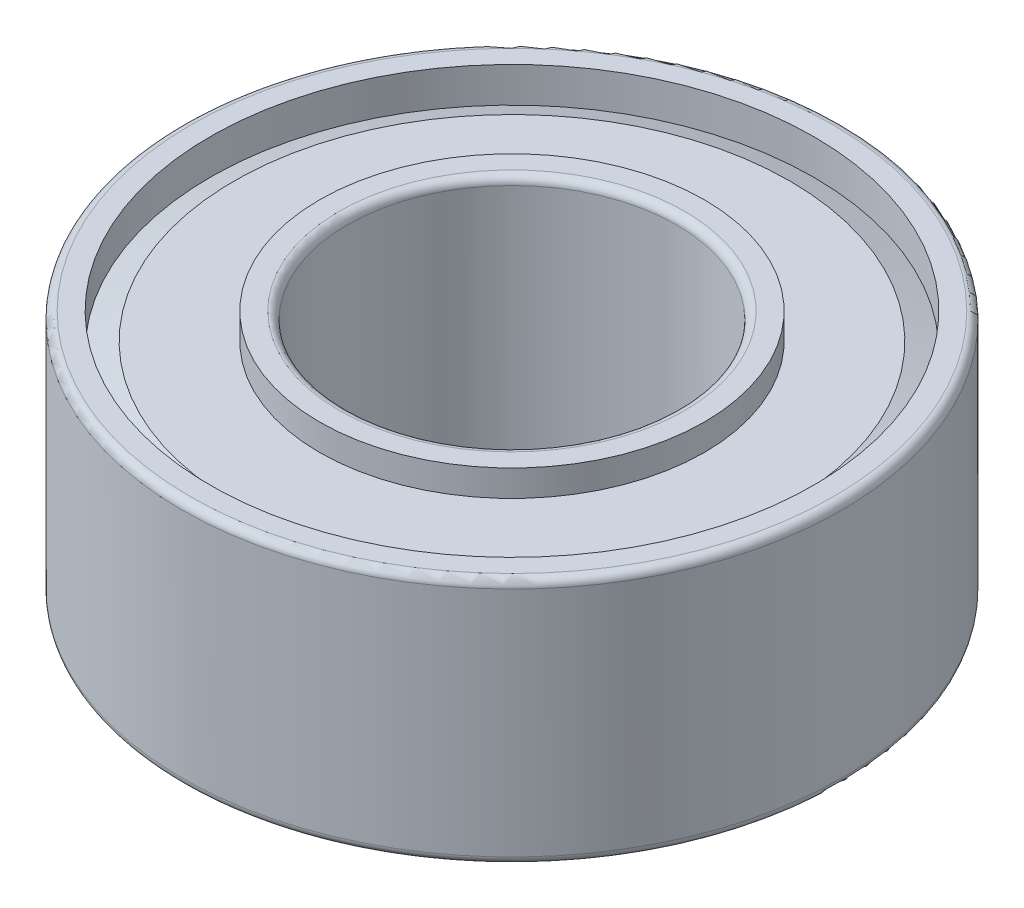
ISO-10303-21;
HEADER;
FILE_DESCRIPTION(('STEP AP214'),'2;1');
FILE_NAME('part.step','',(''),(''),'','','');
FILE_SCHEMA(('AUTOMOTIVE_DESIGN { 1 0 10303 214 1 1 1 1 }'));
ENDSEC;
DATA;
#1=APPLICATION_CONTEXT('core data for automotive mechanical design processes');
#2=APPLICATION_PROTOCOL_DEFINITION('international standard','automotive_design',2000,#1);
#3=PRODUCT_CONTEXT('',#1,'mechanical');
#4=PRODUCT('Part','Part','',(#3));
#5=PRODUCT_RELATED_PRODUCT_CATEGORY('part','',(#4));
#6=PRODUCT_DEFINITION_FORMATION('','',#4);
#7=PRODUCT_DEFINITION_CONTEXT('part definition',#1,'design');
#8=PRODUCT_DEFINITION('design','',#6,#7);
#9=PRODUCT_DEFINITION_SHAPE('','',#8);
#10=(LENGTH_UNIT() NAMED_UNIT(*) SI_UNIT(.MILLI.,.METRE.));
#11=(NAMED_UNIT(*) PLANE_ANGLE_UNIT() SI_UNIT($,.RADIAN.));
#12=(NAMED_UNIT(*) SI_UNIT($,.STERADIAN.) SOLID_ANGLE_UNIT());
#13=UNCERTAINTY_MEASURE_WITH_UNIT(LENGTH_MEASURE(1.E-05),#10,'distance_accuracy_value','');
#14=(GEOMETRIC_REPRESENTATION_CONTEXT(3) GLOBAL_UNCERTAINTY_ASSIGNED_CONTEXT((#13)) GLOBAL_UNIT_ASSIGNED_CONTEXT((#10,
#11,#12)) REPRESENTATION_CONTEXT('',''));
#15=CARTESIAN_POINT('',(0.,0.,0.));
#16=DIRECTION('',(0.,0.,1.));
#17=DIRECTION('',(1.,0.,0.));
#18=AXIS2_PLACEMENT_3D('',#15,#16,#17);
#19=CARTESIAN_POINT('',(3.17500000000001,0.,0.));
#20=DIRECTION('',(0.,-1.,0.));
#21=DIRECTION('',(0.,0.,-1.));
#22=AXIS2_PLACEMENT_3D('',#19,#20,#21);
#23=PLANE('',#22);
#24=CARTESIAN_POINT('',(0.,0.,0.));
#25=DIRECTION('',(0.,-1.,0.));
#26=DIRECTION('',(0.,0.,-1.));
#27=AXIS2_PLACEMENT_3D('',#24,#25,#26);
#28=CIRCLE('',#27,6.1976);
#29=CARTESIAN_POINT('',(0.,0.,-6.1976));
#30=VERTEX_POINT('',#29);
#31=EDGE_CURVE('E46',#30,#30,#28,.T.);
#32=ORIENTED_EDGE('',*,*,#31,.T.);
#33=EDGE_LOOP('',(#32));
#34=FACE_BOUND('',#33,.T.);
#35=CARTESIAN_POINT('',(0.,0.,0.));
#36=DIRECTION('',(0.,-1.,0.));
#37=DIRECTION('',(0.,0.,-1.));
#38=AXIS2_PLACEMENT_3D('',#35,#36,#37);
#39=CIRCLE('',#38,5.8166);
#40=CARTESIAN_POINT('',(0.,0.,-5.8166));
#41=VERTEX_POINT('',#40);
#42=EDGE_CURVE('E99',#41,#41,#39,.T.);
#43=ORIENTED_EDGE('',*,*,#42,.F.);
#44=EDGE_LOOP('',(#43));
#45=FACE_BOUND('',#44,.T.);
#46=ADVANCED_FACE('F37',(#34,#45),#23,.T.);
#47=CARTESIAN_POINT('',(3.175,4.7752,0.));
#48=DIRECTION('',(0.,1.,0.));
#49=DIRECTION('',(0.,0.,1.));
#50=AXIS2_PLACEMENT_3D('',#47,#48,#49);
#51=PLANE('',#50);
#52=CARTESIAN_POINT('',(0.,4.7752,0.));
#53=DIRECTION('',(0.,1.,0.));
#54=DIRECTION('',(0.,0.,1.));
#55=AXIS2_PLACEMENT_3D('',#52,#53,#54);
#56=CIRCLE('',#55,6.1976);
#57=CARTESIAN_POINT('',(0.,4.7752,6.1976));
#58=VERTEX_POINT('',#57);
#59=EDGE_CURVE('E52',#58,#58,#56,.T.);
#60=ORIENTED_EDGE('',*,*,#59,.T.);
#61=EDGE_LOOP('',(#60));
#62=FACE_BOUND('',#61,.T.);
#63=CARTESIAN_POINT('',(0.,4.7752,0.));
#64=DIRECTION('',(0.,-1.,0.));
#65=DIRECTION('',(0.,0.,-1.));
#66=AXIS2_PLACEMENT_3D('',#63,#64,#65);
#67=CIRCLE('',#66,5.8166);
#68=CARTESIAN_POINT('',(0.,4.7752,-5.8166));
#69=VERTEX_POINT('',#68);
#70=EDGE_CURVE('E80',#69,#69,#67,.T.);
#71=ORIENTED_EDGE('',*,*,#70,.T.);
#72=EDGE_LOOP('',(#71));
#73=FACE_BOUND('',#72,.T.);
#74=ADVANCED_FACE('F138',(#62,#73),#51,.T.);
#75=CARTESIAN_POINT('',(0.,0.,0.));
#76=DIRECTION('',(0.,-1.,0.));
#77=DIRECTION('',(0.,0.,-1.));
#78=AXIS2_PLACEMENT_3D('',#75,#76,#77);
#79=CYLINDRICAL_SURFACE('',#78,3.17500000000001);
#80=CARTESIAN_POINT('',(0.,4.6228,0.));
#81=DIRECTION('',(0.,1.,0.));
#82=DIRECTION('',(0.,0.,1.));
#83=AXIS2_PLACEMENT_3D('',#80,#81,#82);
#84=CIRCLE('',#83,3.17500000000001);
#85=CARTESIAN_POINT('',(0.,4.6228,3.17500000000001));
#86=VERTEX_POINT('',#85);
#87=EDGE_CURVE('E68',#86,#86,#84,.T.);
#88=ORIENTED_EDGE('',*,*,#87,.T.);
#89=EDGE_LOOP('',(#88));
#90=FACE_BOUND('',#89,.T.);
#91=CARTESIAN_POINT('',(0.,0.1524,0.));
#92=DIRECTION('',(0.,-1.,0.));
#93=DIRECTION('',(0.,0.,-1.));
#94=AXIS2_PLACEMENT_3D('',#91,#92,#93);
#95=CIRCLE('',#94,3.17500000000001);
#96=CARTESIAN_POINT('',(0.,0.1524,-3.17500000000001));
#97=VERTEX_POINT('',#96);
#98=EDGE_CURVE('E72',#97,#97,#95,.T.);
#99=ORIENTED_EDGE('',*,*,#98,.T.);
#100=EDGE_LOOP('',(#99));
#101=FACE_BOUND('',#100,.T.);
#102=ADVANCED_FACE('F39',(#90,#101),#79,.F.);
#103=CARTESIAN_POINT('',(0.,0.,0.));
#104=DIRECTION('',(0.,-1.,0.));
#105=DIRECTION('',(0.,0.,-1.));
#106=AXIS2_PLACEMENT_3D('',#103,#104,#105);
#107=CIRCLE('',#106,3.32740000000001);
#108=CARTESIAN_POINT('',(0.,0.,-3.32740000000001));
#109=VERTEX_POINT('',#108);
#110=EDGE_CURVE('E10',#109,#109,#107,.F.);
#111=ORIENTED_EDGE('',*,*,#110,.T.);
#112=EDGE_LOOP('',(#111));
#113=FACE_BOUND('',#112,.T.);
#114=CARTESIAN_POINT('',(0.,0.,0.));
#115=DIRECTION('',(0.,-1.,0.));
#116=DIRECTION('',(0.,0.,-1.));
#117=AXIS2_PLACEMENT_3D('',#114,#115,#116);
#118=CIRCLE('',#117,3.7084);
#119=CARTESIAN_POINT('',(0.,0.,-3.7084));
#120=VERTEX_POINT('',#119);
#121=EDGE_CURVE('E114',#120,#120,#118,.T.);
#122=ORIENTED_EDGE('',*,*,#121,.T.);
#123=EDGE_LOOP('',(#122));
#124=FACE_BOUND('',#123,.T.);
#125=ADVANCED_FACE('F119',(#113,#124),#23,.T.);
#126=CARTESIAN_POINT('',(0.,0.,0.));
#127=DIRECTION('',(0.,-1.,0.));
#128=DIRECTION('',(0.,0.,-1.));
#129=AXIS2_PLACEMENT_3D('',#126,#127,#128);
#130=CYLINDRICAL_SURFACE('',#129,6.35);
#131=CARTESIAN_POINT('',(0.,4.6228,0.));
#132=DIRECTION('',(0.,1.,0.));
#133=DIRECTION('',(0.,0.,1.));
#134=AXIS2_PLACEMENT_3D('',#131,#132,#133);
#135=CIRCLE('',#134,6.35);
#136=CARTESIAN_POINT('',(0.,4.6228,6.35));
#137=VERTEX_POINT('',#136);
#138=EDGE_CURVE('E59',#137,#137,#135,.F.);
#139=ORIENTED_EDGE('',*,*,#138,.T.);
#140=EDGE_LOOP('',(#139));
#141=FACE_BOUND('',#140,.T.);
#142=CARTESIAN_POINT('',(0.,0.1524,0.));
#143=DIRECTION('',(0.,-1.,0.));
#144=DIRECTION('',(0.,0.,-1.));
#145=AXIS2_PLACEMENT_3D('',#142,#143,#144);
#146=CIRCLE('',#145,6.35);
#147=CARTESIAN_POINT('',(0.,0.1524,-6.35));
#148=VERTEX_POINT('',#147);
#149=EDGE_CURVE('E64',#148,#148,#146,.F.);
#150=ORIENTED_EDGE('',*,*,#149,.T.);
#151=EDGE_LOOP('',(#150));
#152=FACE_BOUND('',#151,.T.);
#153=ADVANCED_FACE('F148',(#141,#152),#130,.T.);
#154=CARTESIAN_POINT('',(0.,4.7752,0.));
#155=DIRECTION('',(0.,1.,0.));
#156=DIRECTION('',(0.,0.,1.));
#157=AXIS2_PLACEMENT_3D('',#154,#155,#156);
#158=CIRCLE('',#157,3.32740000000001);
#159=CARTESIAN_POINT('',(0.,4.7752,3.32740000000001));
#160=VERTEX_POINT('',#159);
#161=EDGE_CURVE('E76',#160,#160,#158,.F.);
#162=ORIENTED_EDGE('',*,*,#161,.T.);
#163=EDGE_LOOP('',(#162));
#164=FACE_BOUND('',#163,.T.);
#165=CARTESIAN_POINT('',(0.,4.7752,0.));
#166=DIRECTION('',(0.,-1.,0.));
#167=DIRECTION('',(0.,0.,-1.));
#168=AXIS2_PLACEMENT_3D('',#165,#166,#167);
#169=CIRCLE('',#168,3.7084);
#170=CARTESIAN_POINT('',(0.,4.7752,-3.7084));
#171=VERTEX_POINT('',#170);
#172=EDGE_CURVE('E95',#171,#171,#169,.T.);
#173=ORIENTED_EDGE('',*,*,#172,.F.);
#174=EDGE_LOOP('',(#173));
#175=FACE_BOUND('',#174,.T.);
#176=ADVANCED_FACE('F144',(#164,#175),#51,.T.);
#177=CARTESIAN_POINT('',(0.,0.,0.));
#178=DIRECTION('',(0.,-1.,0.));
#179=DIRECTION('',(0.,0.,-1.));
#180=AXIS2_PLACEMENT_3D('',#177,#178,#179);
#181=CYLINDRICAL_SURFACE('',#180,5.8166);
#182=ORIENTED_EDGE('',*,*,#70,.F.);
#183=EDGE_LOOP('',(#182));
#184=FACE_BOUND('',#183,.T.);
#185=CARTESIAN_POINT('',(0.,4.096323786,0.));
#186=DIRECTION('',(0.,-1.,0.));
#187=DIRECTION('',(0.,0.,-1.));
#188=AXIS2_PLACEMENT_3D('',#185,#186,#187);
#189=CIRCLE('',#188,5.8166);
#190=CARTESIAN_POINT('',(0.,4.096323786,-5.8166));
#191=VERTEX_POINT('',#190);
#192=EDGE_CURVE('E84',#191,#191,#189,.T.);
#193=ORIENTED_EDGE('',*,*,#192,.T.);
#194=EDGE_LOOP('',(#193));
#195=FACE_BOUND('',#194,.T.);
#196=ADVANCED_FACE('F186',(#184,#195),#181,.F.);
#197=CARTESIAN_POINT('',(0.,4.2672,0.));
#198=DIRECTION('',(0.,-1.,0.));
#199=DIRECTION('',(0.,0.,-1.));
#200=AXIS2_PLACEMENT_3D('',#197,#198,#199);
#201=CONICAL_SURFACE('',#200,5.353083782,1.21760254480203);
#202=ORIENTED_EDGE('',*,*,#192,.F.);
#203=EDGE_LOOP('',(#202));
#204=FACE_BOUND('',#203,.T.);
#205=CARTESIAN_POINT('',(0.,4.2672,0.));
#206=DIRECTION('',(0.,-1.,0.));
#207=DIRECTION('',(0.,0.,-1.));
#208=AXIS2_PLACEMENT_3D('',#205,#206,#207);
#209=CIRCLE('',#208,5.353083782);
#210=CARTESIAN_POINT('',(0.,4.2672,-5.353083782));
#211=VERTEX_POINT('',#210);
#212=EDGE_CURVE('E87',#211,#211,#209,.T.);
#213=ORIENTED_EDGE('',*,*,#212,.T.);
#214=EDGE_LOOP('',(#213));
#215=FACE_BOUND('',#214,.T.);
#216=ADVANCED_FACE('F189',(#204,#215),#201,.T.);
#217=CARTESIAN_POINT('',(3.7084,4.2672,0.));
#218=DIRECTION('',(0.,-1.,0.));
#219=DIRECTION('',(0.,0.,-1.));
#220=AXIS2_PLACEMENT_3D('',#217,#218,#219);
#221=PLANE('',#220);
#222=ORIENTED_EDGE('',*,*,#212,.F.);
#223=EDGE_LOOP('',(#222));
#224=FACE_BOUND('',#223,.T.);
#225=CARTESIAN_POINT('',(0.,4.2672,0.));
#226=DIRECTION('',(0.,-1.,0.));
#227=DIRECTION('',(0.,0.,-1.));
#228=AXIS2_PLACEMENT_3D('',#225,#226,#227);
#229=CIRCLE('',#228,3.7084);
#230=CARTESIAN_POINT('',(0.,4.2672,-3.7084));
#231=VERTEX_POINT('',#230);
#232=EDGE_CURVE('E91',#231,#231,#229,.T.);
#233=ORIENTED_EDGE('',*,*,#232,.T.);
#234=EDGE_LOOP('',(#233));
#235=FACE_BOUND('',#234,.T.);
#236=ADVANCED_FACE('F195',(#224,#235),#221,.F.);
#237=CARTESIAN_POINT('',(0.,0.,0.));
#238=DIRECTION('',(0.,-1.,0.));
#239=DIRECTION('',(0.,0.,-1.));
#240=AXIS2_PLACEMENT_3D('',#237,#238,#239);
#241=CYLINDRICAL_SURFACE('',#240,3.7084);
#242=ORIENTED_EDGE('',*,*,#232,.F.);
#243=EDGE_LOOP('',(#242));
#244=FACE_BOUND('',#243,.T.);
#245=ORIENTED_EDGE('',*,*,#172,.T.);
#246=EDGE_LOOP('',(#245));
#247=FACE_BOUND('',#246,.T.);
#248=ADVANCED_FACE('F201',(#244,#247),#241,.T.);
#249=CARTESIAN_POINT('',(0.,4.7752,0.));
#250=DIRECTION('',(0.,1.,0.));
#251=DIRECTION('',(0.,0.,-1.));
#252=AXIS2_PLACEMENT_3D('',#249,#250,#251);
#253=CYLINDRICAL_SURFACE('',#252,5.8166);
#254=ORIENTED_EDGE('',*,*,#42,.T.);
#255=EDGE_LOOP('',(#254));
#256=FACE_BOUND('',#255,.T.);
#257=CARTESIAN_POINT('',(0.,0.678876214,0.));
#258=DIRECTION('',(0.,-1.,0.));
#259=DIRECTION('',(0.,0.,-1.));
#260=AXIS2_PLACEMENT_3D('',#257,#258,#259);
#261=CIRCLE('',#260,5.8166);
#262=CARTESIAN_POINT('',(0.,0.678876214,-5.8166));
#263=VERTEX_POINT('',#262);
#264=EDGE_CURVE('E103',#263,#263,#261,.T.);
#265=ORIENTED_EDGE('',*,*,#264,.F.);
#266=EDGE_LOOP('',(#265));
#267=FACE_BOUND('',#266,.T.);
#268=ADVANCED_FACE('F207',(#256,#267),#253,.F.);
#269=CARTESIAN_POINT('',(0.,0.507999999999999,0.));
#270=DIRECTION('',(0.,1.,0.));
#271=DIRECTION('',(0.,0.,-1.));
#272=AXIS2_PLACEMENT_3D('',#269,#270,#271);
#273=CONICAL_SURFACE('',#272,5.353083782,1.21760254480203);
#274=ORIENTED_EDGE('',*,*,#264,.T.);
#275=EDGE_LOOP('',(#274));
#276=FACE_BOUND('',#275,.T.);
#277=CARTESIAN_POINT('',(0.,0.507999999999999,0.));
#278=DIRECTION('',(0.,-1.,0.));
#279=DIRECTION('',(0.,0.,-1.));
#280=AXIS2_PLACEMENT_3D('',#277,#278,#279);
#281=CIRCLE('',#280,5.353083782);
#282=CARTESIAN_POINT('',(0.,0.507999999999999,-5.353083782));
#283=VERTEX_POINT('',#282);
#284=EDGE_CURVE('E107',#283,#283,#281,.T.);
#285=ORIENTED_EDGE('',*,*,#284,.F.);
#286=EDGE_LOOP('',(#285));
#287=FACE_BOUND('',#286,.T.);
#288=ADVANCED_FACE('F134',(#276,#287),#273,.T.);
#289=CARTESIAN_POINT('',(3.7084,0.508,0.));
#290=DIRECTION('',(0.,1.,0.));
#291=DIRECTION('',(0.,0.,-1.));
#292=AXIS2_PLACEMENT_3D('',#289,#290,#291);
#293=PLANE('',#292);
#294=ORIENTED_EDGE('',*,*,#284,.T.);
#295=EDGE_LOOP('',(#294));
#296=FACE_BOUND('',#295,.T.);
#297=CARTESIAN_POINT('',(0.,0.508,0.));
#298=DIRECTION('',(0.,-1.,0.));
#299=DIRECTION('',(0.,0.,-1.));
#300=AXIS2_PLACEMENT_3D('',#297,#298,#299);
#301=CIRCLE('',#300,3.7084);
#302=CARTESIAN_POINT('',(0.,0.508,-3.7084));
#303=VERTEX_POINT('',#302);
#304=EDGE_CURVE('E110',#303,#303,#301,.T.);
#305=ORIENTED_EDGE('',*,*,#304,.F.);
#306=EDGE_LOOP('',(#305));
#307=FACE_BOUND('',#306,.T.);
#308=ADVANCED_FACE('F124',(#296,#307),#293,.F.);
#309=CARTESIAN_POINT('',(0.,4.7752,0.));
#310=DIRECTION('',(0.,1.,0.));
#311=DIRECTION('',(0.,0.,-1.));
#312=AXIS2_PLACEMENT_3D('',#309,#310,#311);
#313=CYLINDRICAL_SURFACE('',#312,3.7084);
#314=ORIENTED_EDGE('',*,*,#304,.T.);
#315=EDGE_LOOP('',(#314));
#316=FACE_BOUND('',#315,.T.);
#317=ORIENTED_EDGE('',*,*,#121,.F.);
#318=EDGE_LOOP('',(#317));
#319=FACE_BOUND('',#318,.T.);
#320=ADVANCED_FACE('F121',(#316,#319),#313,.T.);
#321=CARTESIAN_POINT('',(0.,4.6228,0.));
#322=DIRECTION('',(0.,1.,0.));
#323=DIRECTION('',(0.,0.,1.));
#324=AXIS2_PLACEMENT_3D('',#321,#322,#323);
#325=TOROIDAL_SURFACE('',#324,3.32740000000001,0.1524);
#326=ORIENTED_EDGE('',*,*,#87,.F.);
#327=EDGE_LOOP('',(#326));
#328=FACE_BOUND('',#327,.T.);
#329=ORIENTED_EDGE('',*,*,#161,.F.);
#330=EDGE_LOOP('',(#329));
#331=FACE_BOUND('',#330,.T.);
#332=ADVANCED_FACE('F123',(#328,#331),#325,.T.);
#333=CARTESIAN_POINT('',(0.,4.6228,0.));
#334=DIRECTION('',(0.,1.,0.));
#335=DIRECTION('',(0.,0.,1.));
#336=AXIS2_PLACEMENT_3D('',#333,#334,#335);
#337=TOROIDAL_SURFACE('',#336,6.1976,0.1524);
#338=ORIENTED_EDGE('',*,*,#59,.F.);
#339=EDGE_LOOP('',(#338));
#340=FACE_BOUND('',#339,.T.);
#341=ORIENTED_EDGE('',*,*,#138,.F.);
#342=EDGE_LOOP('',(#341));
#343=FACE_BOUND('',#342,.T.);
#344=ADVANCED_FACE('F131',(#340,#343),#337,.T.);
#345=CARTESIAN_POINT('',(0.,0.1524,0.));
#346=DIRECTION('',(0.,-1.,0.));
#347=DIRECTION('',(0.,0.,-1.));
#348=AXIS2_PLACEMENT_3D('',#345,#346,#347);
#349=TOROIDAL_SURFACE('',#348,6.1976,0.1524);
#350=ORIENTED_EDGE('',*,*,#149,.F.);
#351=EDGE_LOOP('',(#350));
#352=FACE_BOUND('',#351,.T.);
#353=ORIENTED_EDGE('',*,*,#31,.F.);
#354=EDGE_LOOP('',(#353));
#355=FACE_BOUND('',#354,.T.);
#356=ADVANCED_FACE('F163',(#352,#355),#349,.T.);
#357=CARTESIAN_POINT('',(0.,0.1524,0.));
#358=DIRECTION('',(0.,-1.,0.));
#359=DIRECTION('',(0.,0.,-1.));
#360=AXIS2_PLACEMENT_3D('',#357,#358,#359);
#361=TOROIDAL_SURFACE('',#360,3.32740000000001,0.1524);
#362=ORIENTED_EDGE('',*,*,#110,.F.);
#363=EDGE_LOOP('',(#362));
#364=FACE_BOUND('',#363,.T.);
#365=ORIENTED_EDGE('',*,*,#98,.F.);
#366=EDGE_LOOP('',(#365));
#367=FACE_BOUND('',#366,.T.);
#368=ADVANCED_FACE('F161',(#364,#367),#361,.T.);
#369=CLOSED_SHELL('',(#46,#74,#102,#125,#153,#176,#196,#216,#236,#248,#268,#288,#308,#320,#332,
#344,#356,#368));
#370=CARTESIAN_POINT('',(0.,2.3876,0.));
#371=DIRECTION('',(0.,-1.,0.));
#372=DIRECTION('',(0.,0.,-1.));
#373=AXIS2_PLACEMENT_3D('',#370,#371,#372);
#374=TOROIDAL_SURFACE('',#373,4.7625,1.2065);
#375=CARTESIAN_POINT('',(0.,2.3876,-5.969));
#376=VERTEX_POINT('',#375);
#377=VERTEX_LOOP('',#376);
#378=FACE_BOUND('',#377,.T.);
#379=ADVANCED_FACE('F216',(#378),#374,.F.);
#380=CLOSED_SHELL('',(#379));
#381=ORIENTED_CLOSED_SHELL('',*,#380,.T.);
#382=BREP_WITH_VOIDS('B2',#369,(#381));
#383=ADVANCED_BREP_SHAPE_REPRESENTATION('',(#18,#382),#14);
#384=SHAPE_DEFINITION_REPRESENTATION(#9,#383);
ENDSEC;
END-ISO-10303-21;
